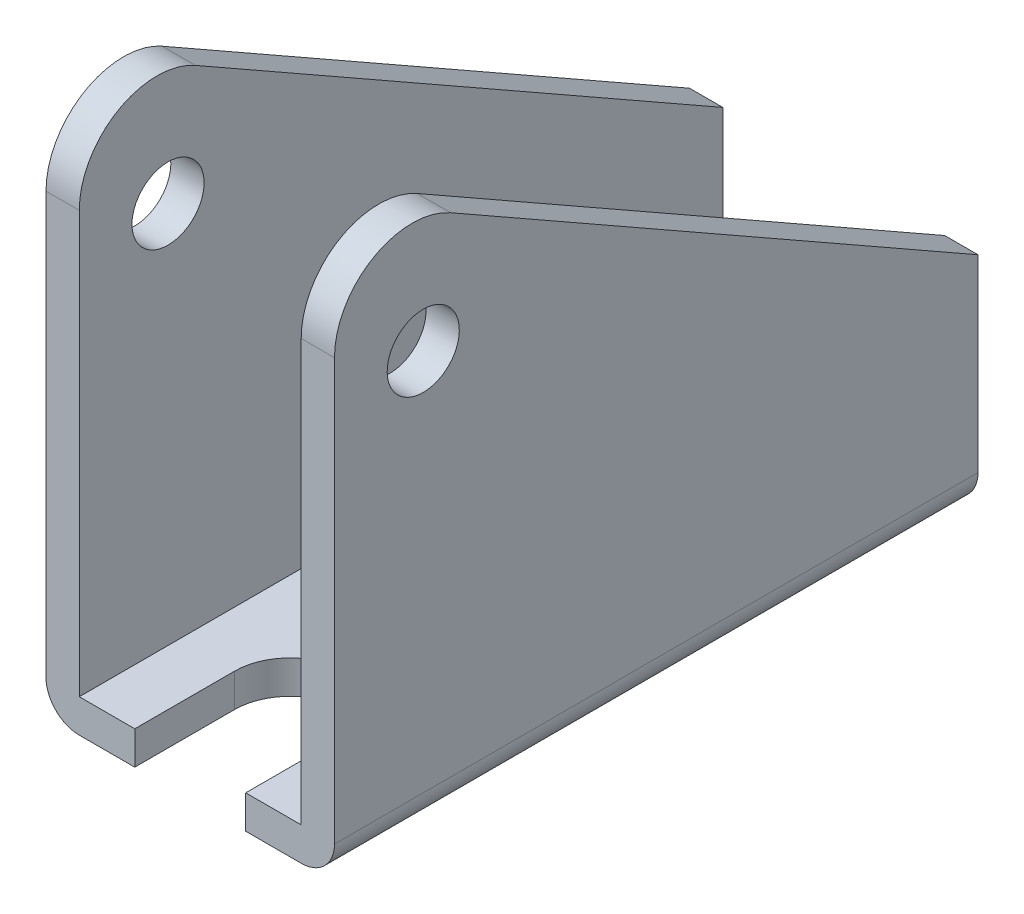
ISO-10303-21;
HEADER;
FILE_DESCRIPTION(('STEP AP214'),'2;1');
FILE_NAME('part.step','',(''),(''),'','','');
FILE_SCHEMA(('AUTOMOTIVE_DESIGN { 1 0 10303 214 1 1 1 1 }'));
ENDSEC;
DATA;
#1=APPLICATION_CONTEXT('core data for automotive mechanical design processes');
#2=APPLICATION_PROTOCOL_DEFINITION('international standard','automotive_design',2000,#1);
#3=PRODUCT_CONTEXT('',#1,'mechanical');
#4=PRODUCT('Part','Part','',(#3));
#5=PRODUCT_RELATED_PRODUCT_CATEGORY('part','',(#4));
#6=PRODUCT_DEFINITION_FORMATION('','',#4);
#7=PRODUCT_DEFINITION_CONTEXT('part definition',#1,'design');
#8=PRODUCT_DEFINITION('design','',#6,#7);
#9=PRODUCT_DEFINITION_SHAPE('','',#8);
#10=(LENGTH_UNIT() NAMED_UNIT(*) SI_UNIT(.MILLI.,.METRE.));
#11=(NAMED_UNIT(*) PLANE_ANGLE_UNIT() SI_UNIT($,.RADIAN.));
#12=(NAMED_UNIT(*) SI_UNIT($,.STERADIAN.) SOLID_ANGLE_UNIT());
#13=UNCERTAINTY_MEASURE_WITH_UNIT(LENGTH_MEASURE(1.E-05),#10,'distance_accuracy_value','');
#14=(GEOMETRIC_REPRESENTATION_CONTEXT(3) GLOBAL_UNCERTAINTY_ASSIGNED_CONTEXT((#13)) GLOBAL_UNIT_ASSIGNED_CONTEXT((#10,
#11,#12)) REPRESENTATION_CONTEXT('',''));
#15=CARTESIAN_POINT('',(0.,0.,0.));
#16=DIRECTION('',(0.,0.,1.));
#17=DIRECTION('',(1.,0.,0.));
#18=AXIS2_PLACEMENT_3D('',#15,#16,#17);
#19=CARTESIAN_POINT('',(0.,0.,58.));
#20=DIRECTION('',(0.,0.,1.));
#21=DIRECTION('',(1.,0.,0.));
#22=AXIS2_PLACEMENT_3D('',#19,#20,#21);
#23=PLANE('',#22);
#24=DIRECTION('',(1.,0.,0.));
#25=VECTOR('',#24,1.);
#26=CARTESIAN_POINT('',(-13.,-75.7978366427297,58.));
#27=LINE('',#26,#25);
#28=CARTESIAN_POINT('',(5.,-75.7978366427297,58.));
#29=VERTEX_POINT('',#28);
#30=CARTESIAN_POINT('',(10.,-75.7978366427297,58.));
#31=VERTEX_POINT('',#30);
#32=EDGE_CURVE('E217',#29,#31,#27,.T.);
#33=ORIENTED_EDGE('',*,*,#32,.T.);
#34=CARTESIAN_POINT('',(10.,-72.7978366427297,58.));
#35=DIRECTION('',(0.,0.,1.));
#36=DIRECTION('',(1.,0.,0.));
#37=AXIS2_PLACEMENT_3D('',#34,#35,#36);
#38=CIRCLE('',#37,3.);
#39=CARTESIAN_POINT('',(13.,-72.7978366427297,58.));
#40=VERTEX_POINT('',#39);
#41=EDGE_CURVE('E11',#31,#40,#38,.T.);
#42=ORIENTED_EDGE('',*,*,#41,.T.);
#43=DIRECTION('',(0.,1.,0.));
#44=VECTOR('',#43,1.);
#45=CARTESIAN_POINT('',(13.,-20.7978366427297,58.));
#46=LINE('',#45,#44);
#47=CARTESIAN_POINT('',(13.,-34.8343128044483,58.));
#48=VERTEX_POINT('',#47);
#49=EDGE_CURVE('E221',#40,#48,#46,.T.);
#50=ORIENTED_EDGE('',*,*,#49,.T.);
#51=DIRECTION('',(1.,0.,0.));
#52=VECTOR('',#51,1.);
#53=CARTESIAN_POINT('',(10.,-34.8343128044483,58.));
#54=LINE('',#53,#52);
#55=CARTESIAN_POINT('',(10.,-34.8343128044483,58.));
#56=VERTEX_POINT('',#55);
#57=EDGE_CURVE('E263',#48,#56,#54,.F.);
#58=ORIENTED_EDGE('',*,*,#57,.T.);
#59=DIRECTION('',(0.,-1.,0.));
#60=VECTOR('',#59,1.);
#61=CARTESIAN_POINT('',(10.,-72.7978366427297,58.));
#62=LINE('',#61,#60);
#63=CARTESIAN_POINT('',(10.,-72.7978366427297,58.));
#64=VERTEX_POINT('',#63);
#65=EDGE_CURVE('E223',#56,#64,#62,.T.);
#66=ORIENTED_EDGE('',*,*,#65,.T.);
#67=DIRECTION('',(-1.,0.,0.));
#68=VECTOR('',#67,1.);
#69=CARTESIAN_POINT('',(-9.99999999999999,-72.7978366427297,58.));
#70=LINE('',#69,#68);
#71=CARTESIAN_POINT('',(5.,-72.7978366427297,58.));
#72=VERTEX_POINT('',#71);
#73=EDGE_CURVE('E226',#64,#72,#70,.T.);
#74=ORIENTED_EDGE('',*,*,#73,.T.);
#75=DIRECTION('',(0.,1.,0.));
#76=VECTOR('',#75,1.);
#77=CARTESIAN_POINT('',(5.,-75.7978366427297,58.));
#78=LINE('',#77,#76);
#79=EDGE_CURVE('E187',#29,#72,#78,.T.);
#80=ORIENTED_EDGE('',*,*,#79,.F.);
#81=EDGE_LOOP('',(#33,#42,#50,#58,#66,#74,#80));
#82=FACE_BOUND('',#81,.T.);
#83=ADVANCED_FACE('F36',(#82),#23,.T.);
#84=CARTESIAN_POINT('',(-13.,-20.7978366427297,58.));
#85=DIRECTION('',(1.,0.,0.));
#86=DIRECTION('',(0.,1.,0.));
#87=AXIS2_PLACEMENT_3D('',#84,#85,#86);
#88=PLANE('',#87);
#89=CARTESIAN_POINT('',(-13.,-38.2978366427297,50.));
#90=DIRECTION('',(1.,0.,0.));
#91=DIRECTION('',(0.,1.,0.));
#92=AXIS2_PLACEMENT_3D('',#89,#90,#91);
#93=CIRCLE('',#92,3.25);
#94=CARTESIAN_POINT('',(-13.,-35.0478366427297,50.));
#95=VERTEX_POINT('',#94);
#96=EDGE_CURVE('E190',#95,#95,#93,.T.);
#97=ORIENTED_EDGE('',*,*,#96,.T.);
#98=EDGE_LOOP('',(#97));
#99=FACE_BOUND('',#98,.T.);
#100=DIRECTION('',(0.,-1.,0.));
#101=VECTOR('',#100,1.);
#102=CARTESIAN_POINT('',(-13.,-20.7978366427297,0.));
#103=LINE('',#102,#101);
#104=CARTESIAN_POINT('',(-13.,-55.7978366427297,0.));
#105=VERTEX_POINT('',#104);
#106=CARTESIAN_POINT('',(-13.,-72.7978366427297,0.));
#107=VERTEX_POINT('',#106);
#108=EDGE_CURVE('E214',#105,#107,#103,.T.);
#109=ORIENTED_EDGE('',*,*,#108,.T.);
#110=DIRECTION('',(0.,0.,-1.));
#111=VECTOR('',#110,1.);
#112=CARTESIAN_POINT('',(-13.,-72.7978366427297,58.));
#113=LINE('',#112,#111);
#114=CARTESIAN_POINT('',(-13.,-72.7978366427297,58.));
#115=VERTEX_POINT('',#114);
#116=EDGE_CURVE('E57',#107,#115,#113,.F.);
#117=ORIENTED_EDGE('',*,*,#116,.T.);
#118=DIRECTION('',(0.,-1.,0.));
#119=VECTOR('',#118,1.);
#120=CARTESIAN_POINT('',(-13.,-20.7978366427297,58.));
#121=LINE('',#120,#119);
#122=CARTESIAN_POINT('',(-13.,-34.8343128044483,58.));
#123=VERTEX_POINT('',#122);
#124=EDGE_CURVE('E215',#123,#115,#121,.T.);
#125=ORIENTED_EDGE('',*,*,#124,.F.);
#126=CARTESIAN_POINT('',(-13.,-34.8343128044483,51.));
#127=DIRECTION('',(1.,0.,0.));
#128=DIRECTION('',(0.,1.,0.));
#129=AXIS2_PLACEMENT_3D('',#126,#127,#128);
#130=CIRCLE('',#129,7.);
#131=CARTESIAN_POINT('',(-13.,-28.75016598028,47.5383302552146));
#132=VERTEX_POINT('',#131);
#133=EDGE_CURVE('E272',#123,#132,#130,.F.);
#134=ORIENTED_EDGE('',*,*,#133,.T.);
#135=DIRECTION('',(0.,-0.494524249255059,-0.869163832024044));
#136=VECTOR('',#135,1.);
#137=CARTESIAN_POINT('',(-13.,-22.7978366427297,58.));
#138=LINE('',#137,#136);
#139=EDGE_CURVE('E198',#132,#105,#138,.T.);
#140=ORIENTED_EDGE('',*,*,#139,.T.);
#141=EDGE_LOOP('',(#109,#117,#125,#134,#140));
#142=FACE_BOUND('',#141,.T.);
#143=ADVANCED_FACE('F325',(#99,#142),#88,.F.);
#144=CARTESIAN_POINT('',(-13.,-75.7978366427297,58.));
#145=DIRECTION('',(0.,1.,0.));
#146=DIRECTION('',(0.,0.,1.));
#147=AXIS2_PLACEMENT_3D('',#144,#145,#146);
#148=PLANE('',#147);
#149=CARTESIAN_POINT('',(0.,-75.7978366427297,12.));
#150=DIRECTION('',(0.,1.,0.));
#151=DIRECTION('',(0.,0.,1.));
#152=AXIS2_PLACEMENT_3D('',#149,#150,#151);
#153=CIRCLE('',#152,4.5);
#154=CARTESIAN_POINT('',(0.,-75.7978366427297,16.5));
#155=VERTEX_POINT('',#154);
#156=EDGE_CURVE('E197',#155,#155,#153,.T.);
#157=ORIENTED_EDGE('',*,*,#156,.T.);
#158=EDGE_LOOP('',(#157));
#159=FACE_BOUND('',#158,.T.);
#160=CARTESIAN_POINT('',(-9.99999999999999,-75.7978366427297,58.));
#161=VERTEX_POINT('',#160);
#162=CARTESIAN_POINT('',(-5.,-75.7978366427297,58.));
#163=VERTEX_POINT('',#162);
#164=EDGE_CURVE('E219',#161,#163,#27,.T.);
#165=ORIENTED_EDGE('',*,*,#164,.F.);
#166=DIRECTION('',(0.,0.,-1.));
#167=VECTOR('',#166,1.);
#168=CARTESIAN_POINT('',(-9.99999999999999,-75.7978366427297,58.));
#169=LINE('',#168,#167);
#170=CARTESIAN_POINT('',(-9.99999999999999,-75.7978366427297,0.));
#171=VERTEX_POINT('',#170);
#172=EDGE_CURVE('E276',#161,#171,#169,.T.);
#173=ORIENTED_EDGE('',*,*,#172,.T.);
#174=DIRECTION('',(1.,0.,0.));
#175=VECTOR('',#174,1.);
#176=CARTESIAN_POINT('',(-13.,-75.7978366427297,0.));
#177=LINE('',#176,#175);
#178=CARTESIAN_POINT('',(10.,-75.7978366427297,0.));
#179=VERTEX_POINT('',#178);
#180=EDGE_CURVE('E234',#171,#179,#177,.T.);
#181=ORIENTED_EDGE('',*,*,#180,.T.);
#182=DIRECTION('',(0.,0.,-1.));
#183=VECTOR('',#182,1.);
#184=CARTESIAN_POINT('',(10.,-75.7978366427297,58.));
#185=LINE('',#184,#183);
#186=EDGE_CURVE('E274',#179,#31,#185,.F.);
#187=ORIENTED_EDGE('',*,*,#186,.T.);
#188=ORIENTED_EDGE('',*,*,#32,.F.);
#189=DIRECTION('',(0.,0.,-1.));
#190=VECTOR('',#189,1.);
#191=CARTESIAN_POINT('',(4.99999999999999,-75.7978366427297,49.));
#192=LINE('',#191,#190);
#193=CARTESIAN_POINT('',(4.99999999999999,-75.7978366427297,49.));
#194=VERTEX_POINT('',#193);
#195=EDGE_CURVE('E161',#29,#194,#192,.T.);
#196=ORIENTED_EDGE('',*,*,#195,.T.);
#197=CARTESIAN_POINT('',(0.,-75.7978366427297,49.));
#198=DIRECTION('',(0.,1.,0.));
#199=DIRECTION('',(0.,0.,1.));
#200=AXIS2_PLACEMENT_3D('',#197,#198,#199);
#201=CIRCLE('',#200,4.99999999999999);
#202=CARTESIAN_POINT('',(-4.99999999999999,-75.7978366427297,49.));
#203=VERTEX_POINT('',#202);
#204=EDGE_CURVE('E154',#194,#203,#201,.T.);
#205=ORIENTED_EDGE('',*,*,#204,.T.);
#206=DIRECTION('',(0.,0.,1.));
#207=VECTOR('',#206,1.);
#208=CARTESIAN_POINT('',(-4.99999999999999,-75.7978366427297,49.));
#209=LINE('',#208,#207);
#210=EDGE_CURVE('E165',#203,#163,#209,.T.);
#211=ORIENTED_EDGE('',*,*,#210,.T.);
#212=EDGE_LOOP('',(#165,#173,#181,#187,#188,#196,#205,#211));
#213=FACE_BOUND('',#212,.T.);
#214=ADVANCED_FACE('F171',(#159,#213),#148,.F.);
#215=CARTESIAN_POINT('',(13.,-20.7978366427297,58.));
#216=DIRECTION('',(-1.,0.,0.));
#217=DIRECTION('',(0.,-1.,0.));
#218=AXIS2_PLACEMENT_3D('',#215,#216,#217);
#219=PLANE('',#218);
#220=CARTESIAN_POINT('',(13.,-38.2978366427297,50.));
#221=DIRECTION('',(1.,0.,0.));
#222=DIRECTION('',(0.,1.,0.));
#223=AXIS2_PLACEMENT_3D('',#220,#221,#222);
#224=CIRCLE('',#223,3.25);
#225=CARTESIAN_POINT('',(13.,-35.0478366427297,50.));
#226=VERTEX_POINT('',#225);
#227=EDGE_CURVE('E194',#226,#226,#224,.T.);
#228=ORIENTED_EDGE('',*,*,#227,.F.);
#229=EDGE_LOOP('',(#228));
#230=FACE_BOUND('',#229,.T.);
#231=ORIENTED_EDGE('',*,*,#49,.F.);
#232=DIRECTION('',(0.,0.,-1.));
#233=VECTOR('',#232,1.);
#234=CARTESIAN_POINT('',(13.,-72.7978366427297,58.));
#235=LINE('',#234,#233);
#236=CARTESIAN_POINT('',(13.,-72.7978366427297,0.));
#237=VERTEX_POINT('',#236);
#238=EDGE_CURVE('E44',#40,#237,#235,.T.);
#239=ORIENTED_EDGE('',*,*,#238,.T.);
#240=DIRECTION('',(0.,1.,0.));
#241=VECTOR('',#240,1.);
#242=CARTESIAN_POINT('',(13.,-20.7978366427297,0.));
#243=LINE('',#242,#241);
#244=CARTESIAN_POINT('',(13.,-55.7978366427297,0.));
#245=VERTEX_POINT('',#244);
#246=EDGE_CURVE('E237',#237,#245,#243,.T.);
#247=ORIENTED_EDGE('',*,*,#246,.T.);
#248=DIRECTION('',(0.,-0.494524249255059,-0.869163832024044));
#249=VECTOR('',#248,1.);
#250=CARTESIAN_POINT('',(13.,-22.7978366427297,58.));
#251=LINE('',#250,#249);
#252=CARTESIAN_POINT('',(13.,-28.75016598028,47.5383302552146));
#253=VERTEX_POINT('',#252);
#254=EDGE_CURVE('E193',#253,#245,#251,.T.);
#255=ORIENTED_EDGE('',*,*,#254,.F.);
#256=CARTESIAN_POINT('',(13.,-34.8343128044483,51.));
#257=DIRECTION('',(-1.,0.,0.));
#258=DIRECTION('',(0.,-1.,0.));
#259=AXIS2_PLACEMENT_3D('',#256,#257,#258);
#260=CIRCLE('',#259,7.);
#261=EDGE_CURVE('E258',#253,#48,#260,.F.);
#262=ORIENTED_EDGE('',*,*,#261,.T.);
#263=EDGE_LOOP('',(#231,#239,#247,#255,#262));
#264=FACE_BOUND('',#263,.T.);
#265=ADVANCED_FACE('F289',(#230,#264),#219,.F.);
#266=CARTESIAN_POINT('',(10.,-72.7978366427297,58.));
#267=DIRECTION('',(1.,0.,0.));
#268=DIRECTION('',(0.,1.,0.));
#269=AXIS2_PLACEMENT_3D('',#266,#267,#268);
#270=PLANE('',#269);
#271=CARTESIAN_POINT('',(10.,-38.2978366427297,50.));
#272=DIRECTION('',(1.,0.,0.));
#273=DIRECTION('',(0.,1.,0.));
#274=AXIS2_PLACEMENT_3D('',#271,#272,#273);
#275=CIRCLE('',#274,3.25);
#276=CARTESIAN_POINT('',(10.,-35.0478366427297,50.));
#277=VERTEX_POINT('',#276);
#278=EDGE_CURVE('E211',#277,#277,#275,.T.);
#279=ORIENTED_EDGE('',*,*,#278,.T.);
#280=EDGE_LOOP('',(#279));
#281=FACE_BOUND('',#280,.T.);
#282=ORIENTED_EDGE('',*,*,#65,.F.);
#283=CARTESIAN_POINT('',(10.,-34.8343128044483,51.));
#284=DIRECTION('',(1.,0.,0.));
#285=DIRECTION('',(0.,1.,0.));
#286=AXIS2_PLACEMENT_3D('',#283,#284,#285);
#287=CIRCLE('',#286,7.);
#288=CARTESIAN_POINT('',(10.,-28.75016598028,47.5383302552146));
#289=VERTEX_POINT('',#288);
#290=EDGE_CURVE('E265',#56,#289,#287,.F.);
#291=ORIENTED_EDGE('',*,*,#290,.T.);
#292=DIRECTION('',(0.,-0.494524249255059,-0.869163832024044));
#293=VECTOR('',#292,1.);
#294=CARTESIAN_POINT('',(10.,-35.0255482977937,36.508870424433));
#295=LINE('',#294,#293);
#296=CARTESIAN_POINT('',(10.,-55.7978366427297,0.));
#297=VERTEX_POINT('',#296);
#298=EDGE_CURVE('E208',#289,#297,#295,.T.);
#299=ORIENTED_EDGE('',*,*,#298,.T.);
#300=DIRECTION('',(0.,-1.,0.));
#301=VECTOR('',#300,1.);
#302=CARTESIAN_POINT('',(10.,-72.7978366427297,0.));
#303=LINE('',#302,#301);
#304=CARTESIAN_POINT('',(10.,-72.7978366427297,0.));
#305=VERTEX_POINT('',#304);
#306=EDGE_CURVE('E239',#297,#305,#303,.T.);
#307=ORIENTED_EDGE('',*,*,#306,.T.);
#308=DIRECTION('',(0.,0.,-1.));
#309=VECTOR('',#308,1.);
#310=CARTESIAN_POINT('',(10.,-72.7978366427297,58.));
#311=LINE('',#310,#309);
#312=EDGE_CURVE('E247',#64,#305,#311,.T.);
#313=ORIENTED_EDGE('',*,*,#312,.F.);
#314=EDGE_LOOP('',(#282,#291,#299,#307,#313));
#315=FACE_BOUND('',#314,.T.);
#316=ADVANCED_FACE('F309',(#281,#315),#270,.F.);
#317=CARTESIAN_POINT('',(-9.99999999999999,-72.7978366427297,58.));
#318=DIRECTION('',(0.,-1.,0.));
#319=DIRECTION('',(0.,0.,-1.));
#320=AXIS2_PLACEMENT_3D('',#317,#318,#319);
#321=PLANE('',#320);
#322=CARTESIAN_POINT('',(0.,-72.7978366427297,12.));
#323=DIRECTION('',(0.,1.,0.));
#324=DIRECTION('',(0.,0.,1.));
#325=AXIS2_PLACEMENT_3D('',#322,#323,#324);
#326=CIRCLE('',#325,4.5);
#327=CARTESIAN_POINT('',(0.,-72.7978366427297,16.5));
#328=VERTEX_POINT('',#327);
#329=EDGE_CURVE('E179',#328,#328,#326,.T.);
#330=ORIENTED_EDGE('',*,*,#329,.F.);
#331=EDGE_LOOP('',(#330));
#332=FACE_BOUND('',#331,.T.);
#333=CARTESIAN_POINT('',(0.,-72.7978366427297,49.));
#334=DIRECTION('',(0.,1.,0.));
#335=DIRECTION('',(0.,0.,1.));
#336=AXIS2_PLACEMENT_3D('',#333,#334,#335);
#337=CIRCLE('',#336,4.99999999999999);
#338=CARTESIAN_POINT('',(4.99999999999999,-72.7978366427297,49.));
#339=VERTEX_POINT('',#338);
#340=CARTESIAN_POINT('',(-4.99999999999999,-72.7978366427297,49.));
#341=VERTEX_POINT('',#340);
#342=EDGE_CURVE('E157',#339,#341,#337,.T.);
#343=ORIENTED_EDGE('',*,*,#342,.F.);
#344=DIRECTION('',(0.,0.,-1.));
#345=VECTOR('',#344,1.);
#346=CARTESIAN_POINT('',(4.99999999999999,-72.7978366427297,49.));
#347=LINE('',#346,#345);
#348=EDGE_CURVE('E173',#72,#339,#347,.T.);
#349=ORIENTED_EDGE('',*,*,#348,.F.);
#350=ORIENTED_EDGE('',*,*,#73,.F.);
#351=ORIENTED_EDGE('',*,*,#312,.T.);
#352=DIRECTION('',(-1.,0.,0.));
#353=VECTOR('',#352,1.);
#354=CARTESIAN_POINT('',(-9.99999999999999,-72.7978366427297,0.));
#355=LINE('',#354,#353);
#356=CARTESIAN_POINT('',(-9.99999999999999,-72.7978366427297,0.));
#357=VERTEX_POINT('',#356);
#358=EDGE_CURVE('E241',#305,#357,#355,.T.);
#359=ORIENTED_EDGE('',*,*,#358,.T.);
#360=DIRECTION('',(0.,0.,-1.));
#361=VECTOR('',#360,1.);
#362=CARTESIAN_POINT('',(-9.99999999999999,-72.7978366427297,58.));
#363=LINE('',#362,#361);
#364=CARTESIAN_POINT('',(-9.99999999999999,-72.7978366427297,58.));
#365=VERTEX_POINT('',#364);
#366=EDGE_CURVE('E232',#365,#357,#363,.T.);
#367=ORIENTED_EDGE('',*,*,#366,.F.);
#368=CARTESIAN_POINT('',(-5.,-72.7978366427297,58.));
#369=VERTEX_POINT('',#368);
#370=EDGE_CURVE('E225',#369,#365,#70,.T.);
#371=ORIENTED_EDGE('',*,*,#370,.F.);
#372=DIRECTION('',(0.,0.,1.));
#373=VECTOR('',#372,1.);
#374=CARTESIAN_POINT('',(-4.99999999999999,-72.7978366427297,49.));
#375=LINE('',#374,#373);
#376=EDGE_CURVE('E176',#341,#369,#375,.T.);
#377=ORIENTED_EDGE('',*,*,#376,.F.);
#378=EDGE_LOOP('',(#343,#349,#350,#351,#359,#367,#371,#377));
#379=FACE_BOUND('',#378,.T.);
#380=ADVANCED_FACE('F313',(#332,#379),#321,.F.);
#381=CARTESIAN_POINT('',(-9.99999999999999,-20.7978366427297,58.));
#382=DIRECTION('',(-1.,0.,0.));
#383=DIRECTION('',(0.,-1.,0.));
#384=AXIS2_PLACEMENT_3D('',#381,#382,#383);
#385=PLANE('',#384);
#386=CARTESIAN_POINT('',(-9.99999999999999,-38.2978366427297,50.));
#387=DIRECTION('',(-1.,0.,0.));
#388=DIRECTION('',(0.,-1.,0.));
#389=AXIS2_PLACEMENT_3D('',#386,#387,#388);
#390=CIRCLE('',#389,3.25);
#391=CARTESIAN_POINT('',(-9.99999999999999,-41.5478366427297,50.));
#392=VERTEX_POINT('',#391);
#393=EDGE_CURVE('E210',#392,#392,#390,.T.);
#394=ORIENTED_EDGE('',*,*,#393,.T.);
#395=EDGE_LOOP('',(#394));
#396=FACE_BOUND('',#395,.T.);
#397=DIRECTION('',(0.,0.494524249255059,0.869163832024044));
#398=VECTOR('',#397,1.);
#399=CARTESIAN_POINT('',(-9.99999999999999,-22.3087281765271,58.8596451830227));
#400=LINE('',#399,#398);
#401=CARTESIAN_POINT('',(-9.99999999999999,-55.7978366427297,0.));
#402=VERTEX_POINT('',#401);
#403=CARTESIAN_POINT('',(-9.99999999999999,-28.75016598028,47.5383302552146));
#404=VERTEX_POINT('',#403);
#405=EDGE_CURVE('E205',#402,#404,#400,.T.);
#406=ORIENTED_EDGE('',*,*,#405,.T.);
#407=CARTESIAN_POINT('',(-9.99999999999999,-34.8343128044483,51.));
#408=DIRECTION('',(-1.,0.,0.));
#409=DIRECTION('',(0.,-1.,0.));
#410=AXIS2_PLACEMENT_3D('',#407,#408,#409);
#411=CIRCLE('',#410,7.);
#412=CARTESIAN_POINT('',(-9.99999999999999,-34.8343128044483,58.));
#413=VERTEX_POINT('',#412);
#414=EDGE_CURVE('E270',#404,#413,#411,.F.);
#415=ORIENTED_EDGE('',*,*,#414,.T.);
#416=DIRECTION('',(0.,1.,0.));
#417=VECTOR('',#416,1.);
#418=CARTESIAN_POINT('',(-9.99999999999999,-20.7978366427297,58.));
#419=LINE('',#418,#417);
#420=EDGE_CURVE('E229',#365,#413,#419,.T.);
#421=ORIENTED_EDGE('',*,*,#420,.F.);
#422=ORIENTED_EDGE('',*,*,#366,.T.);
#423=DIRECTION('',(0.,1.,0.));
#424=VECTOR('',#423,1.);
#425=CARTESIAN_POINT('',(-9.99999999999999,-20.7978366427297,0.));
#426=LINE('',#425,#424);
#427=EDGE_CURVE('E218',#357,#402,#426,.T.);
#428=ORIENTED_EDGE('',*,*,#427,.T.);
#429=EDGE_LOOP('',(#406,#415,#421,#422,#428));
#430=FACE_BOUND('',#429,.T.);
#431=ADVANCED_FACE('F336',(#396,#430),#385,.F.);
#432=ORIENTED_EDGE('',*,*,#124,.T.);
#433=CARTESIAN_POINT('',(-9.99999999999999,-72.7978366427297,58.));
#434=DIRECTION('',(0.,0.,1.));
#435=DIRECTION('',(1.,0.,0.));
#436=AXIS2_PLACEMENT_3D('',#433,#434,#435);
#437=CIRCLE('',#436,3.);
#438=EDGE_CURVE('E284',#115,#161,#437,.T.);
#439=ORIENTED_EDGE('',*,*,#438,.T.);
#440=ORIENTED_EDGE('',*,*,#164,.T.);
#441=DIRECTION('',(0.,1.,0.));
#442=VECTOR('',#441,1.);
#443=CARTESIAN_POINT('',(-5.,-75.7978366427297,58.));
#444=LINE('',#443,#442);
#445=EDGE_CURVE('E160',#163,#369,#444,.T.);
#446=ORIENTED_EDGE('',*,*,#445,.T.);
#447=ORIENTED_EDGE('',*,*,#370,.T.);
#448=ORIENTED_EDGE('',*,*,#420,.T.);
#449=DIRECTION('',(1.,0.,0.));
#450=VECTOR('',#449,1.);
#451=CARTESIAN_POINT('',(-13.,-34.8343128044483,58.));
#452=LINE('',#451,#450);
#453=EDGE_CURVE('E261',#413,#123,#452,.F.);
#454=ORIENTED_EDGE('',*,*,#453,.T.);
#455=EDGE_LOOP('',(#432,#439,#440,#446,#447,#448,#454));
#456=FACE_BOUND('',#455,.T.);
#457=ADVANCED_FACE('F327',(#456),#23,.T.);
#458=CARTESIAN_POINT('',(0.,0.,0.));
#459=DIRECTION('',(0.,0.,1.));
#460=DIRECTION('',(1.,0.,0.));
#461=AXIS2_PLACEMENT_3D('',#458,#459,#460);
#462=PLANE('',#461);
#463=ORIENTED_EDGE('',*,*,#180,.F.);
#464=CARTESIAN_POINT('',(-9.99999999999999,-72.7978366427297,0.));
#465=DIRECTION('',(0.,0.,1.));
#466=DIRECTION('',(1.,0.,0.));
#467=AXIS2_PLACEMENT_3D('',#464,#465,#466);
#468=CIRCLE('',#467,3.);
#469=EDGE_CURVE('E281',#171,#107,#468,.F.);
#470=ORIENTED_EDGE('',*,*,#469,.T.);
#471=ORIENTED_EDGE('',*,*,#108,.F.);
#472=DIRECTION('',(1.,0.,0.));
#473=VECTOR('',#472,1.);
#474=CARTESIAN_POINT('',(-13.,-55.7978366427297,0.));
#475=LINE('',#474,#473);
#476=EDGE_CURVE('E200',#105,#402,#475,.T.);
#477=ORIENTED_EDGE('',*,*,#476,.T.);
#478=ORIENTED_EDGE('',*,*,#427,.F.);
#479=ORIENTED_EDGE('',*,*,#358,.F.);
#480=ORIENTED_EDGE('',*,*,#306,.F.);
#481=DIRECTION('',(1.,0.,0.));
#482=VECTOR('',#481,1.);
#483=CARTESIAN_POINT('',(0.,-55.7978366427297,0.));
#484=LINE('',#483,#482);
#485=EDGE_CURVE('E250',#297,#245,#484,.T.);
#486=ORIENTED_EDGE('',*,*,#485,.T.);
#487=ORIENTED_EDGE('',*,*,#246,.F.);
#488=CARTESIAN_POINT('',(10.,-72.7978366427297,0.));
#489=DIRECTION('',(0.,0.,1.));
#490=DIRECTION('',(1.,0.,0.));
#491=AXIS2_PLACEMENT_3D('',#488,#489,#490);
#492=CIRCLE('',#491,3.);
#493=EDGE_CURVE('E279',#237,#179,#492,.F.);
#494=ORIENTED_EDGE('',*,*,#493,.T.);
#495=EDGE_LOOP('',(#463,#470,#471,#477,#478,#479,#480,#486,#487,#494));
#496=FACE_BOUND('',#495,.T.);
#497=ADVANCED_FACE('F294',(#496),#462,.F.);
#498=CARTESIAN_POINT('',(-13.,-22.7978366427297,58.));
#499=DIRECTION('',(0.,-0.869163832024044,0.494524249255059));
#500=DIRECTION('',(0.,-0.494524249255059,-0.869163832024044));
#501=AXIS2_PLACEMENT_3D('',#498,#499,#500);
#502=PLANE('',#501);
#503=ORIENTED_EDGE('',*,*,#298,.F.);
#504=DIRECTION('',(1.,0.,0.));
#505=VECTOR('',#504,1.);
#506=CARTESIAN_POINT('',(13.,-28.75016598028,47.5383302552146));
#507=LINE('',#506,#505);
#508=EDGE_CURVE('E253',#289,#253,#507,.T.);
#509=ORIENTED_EDGE('',*,*,#508,.T.);
#510=ORIENTED_EDGE('',*,*,#254,.T.);
#511=ORIENTED_EDGE('',*,*,#485,.F.);
#512=EDGE_LOOP('',(#503,#509,#510,#511));
#513=FACE_BOUND('',#512,.T.);
#514=ADVANCED_FACE('F300',(#513),#502,.F.);
#515=ORIENTED_EDGE('',*,*,#139,.F.);
#516=DIRECTION('',(1.,0.,0.));
#517=VECTOR('',#516,1.);
#518=CARTESIAN_POINT('',(-9.99999999999999,-28.75016598028,47.5383302552146));
#519=LINE('',#518,#517);
#520=EDGE_CURVE('E267',#132,#404,#519,.T.);
#521=ORIENTED_EDGE('',*,*,#520,.T.);
#522=ORIENTED_EDGE('',*,*,#405,.F.);
#523=ORIENTED_EDGE('',*,*,#476,.F.);
#524=EDGE_LOOP('',(#515,#521,#522,#523));
#525=FACE_BOUND('',#524,.T.);
#526=ADVANCED_FACE('F353',(#525),#502,.F.);
#527=CARTESIAN_POINT('',(-13.,-38.2978366427297,50.));
#528=DIRECTION('',(1.,0.,0.));
#529=DIRECTION('',(0.,1.,0.));
#530=AXIS2_PLACEMENT_3D('',#527,#528,#529);
#531=CYLINDRICAL_SURFACE('',#530,3.25);
#532=ORIENTED_EDGE('',*,*,#96,.F.);
#533=EDGE_LOOP('',(#532));
#534=FACE_BOUND('',#533,.T.);
#535=ORIENTED_EDGE('',*,*,#393,.F.);
#536=EDGE_LOOP('',(#535));
#537=FACE_BOUND('',#536,.T.);
#538=ADVANCED_FACE('F401',(#534,#537),#531,.F.);
#539=ORIENTED_EDGE('',*,*,#227,.T.);
#540=EDGE_LOOP('',(#539));
#541=FACE_BOUND('',#540,.T.);
#542=ORIENTED_EDGE('',*,*,#278,.F.);
#543=EDGE_LOOP('',(#542));
#544=FACE_BOUND('',#543,.T.);
#545=ADVANCED_FACE('F369',(#541,#544),#531,.F.);
#546=CARTESIAN_POINT('',(-13.,-34.8343128044483,51.));
#547=DIRECTION('',(-1.,0.,0.));
#548=DIRECTION('',(0.,-1.,0.));
#549=AXIS2_PLACEMENT_3D('',#546,#547,#548);
#550=CYLINDRICAL_SURFACE('',#549,7.);
#551=ORIENTED_EDGE('',*,*,#290,.F.);
#552=ORIENTED_EDGE('',*,*,#57,.F.);
#553=ORIENTED_EDGE('',*,*,#261,.F.);
#554=ORIENTED_EDGE('',*,*,#508,.F.);
#555=EDGE_LOOP('',(#551,#552,#553,#554));
#556=FACE_BOUND('',#555,.T.);
#557=ADVANCED_FACE('F305',(#556),#550,.T.);
#558=CARTESIAN_POINT('',(-13.,-34.8343128044483,51.));
#559=DIRECTION('',(-1.,0.,0.));
#560=DIRECTION('',(0.,-1.,0.));
#561=AXIS2_PLACEMENT_3D('',#558,#559,#560);
#562=CYLINDRICAL_SURFACE('',#561,7.);
#563=ORIENTED_EDGE('',*,*,#133,.F.);
#564=ORIENTED_EDGE('',*,*,#453,.F.);
#565=ORIENTED_EDGE('',*,*,#414,.F.);
#566=ORIENTED_EDGE('',*,*,#520,.F.);
#567=EDGE_LOOP('',(#563,#564,#565,#566));
#568=FACE_BOUND('',#567,.T.);
#569=ADVANCED_FACE('F360',(#568),#562,.T.);
#570=CARTESIAN_POINT('',(0.,-75.7978366427297,49.));
#571=DIRECTION('',(0.,1.,0.));
#572=DIRECTION('',(0.,0.,1.));
#573=AXIS2_PLACEMENT_3D('',#570,#571,#572);
#574=CYLINDRICAL_SURFACE('',#573,4.99999999999999);
#575=ORIENTED_EDGE('',*,*,#342,.T.);
#576=DIRECTION('',(0.,1.,0.));
#577=VECTOR('',#576,1.);
#578=CARTESIAN_POINT('',(-4.99999999999999,-75.7978366427297,49.));
#579=LINE('',#578,#577);
#580=EDGE_CURVE('E150',#203,#341,#579,.T.);
#581=ORIENTED_EDGE('',*,*,#580,.F.);
#582=ORIENTED_EDGE('',*,*,#204,.F.);
#583=DIRECTION('',(0.,1.,0.));
#584=VECTOR('',#583,1.);
#585=CARTESIAN_POINT('',(4.99999999999999,-75.7978366427297,49.));
#586=LINE('',#585,#584);
#587=EDGE_CURVE('E185',#194,#339,#586,.T.);
#588=ORIENTED_EDGE('',*,*,#587,.T.);
#589=EDGE_LOOP('',(#575,#581,#582,#588));
#590=FACE_BOUND('',#589,.T.);
#591=ADVANCED_FACE('F152',(#590),#574,.F.);
#592=CARTESIAN_POINT('',(4.99999999999999,-75.7978366427297,49.));
#593=DIRECTION('',(1.,0.,0.));
#594=DIRECTION('',(0.,0.,-1.));
#595=AXIS2_PLACEMENT_3D('',#592,#593,#594);
#596=PLANE('',#595);
#597=ORIENTED_EDGE('',*,*,#348,.T.);
#598=ORIENTED_EDGE('',*,*,#587,.F.);
#599=ORIENTED_EDGE('',*,*,#195,.F.);
#600=ORIENTED_EDGE('',*,*,#79,.T.);
#601=EDGE_LOOP('',(#597,#598,#599,#600));
#602=FACE_BOUND('',#601,.T.);
#603=ADVANCED_FACE('F367',(#602),#596,.F.);
#604=CARTESIAN_POINT('',(-4.99999999999999,-75.7978366427297,49.));
#605=DIRECTION('',(-1.,0.,0.));
#606=DIRECTION('',(0.,0.,1.));
#607=AXIS2_PLACEMENT_3D('',#604,#605,#606);
#608=PLANE('',#607);
#609=ORIENTED_EDGE('',*,*,#376,.T.);
#610=ORIENTED_EDGE('',*,*,#445,.F.);
#611=ORIENTED_EDGE('',*,*,#210,.F.);
#612=ORIENTED_EDGE('',*,*,#580,.T.);
#613=EDGE_LOOP('',(#609,#610,#611,#612));
#614=FACE_BOUND('',#613,.T.);
#615=ADVANCED_FACE('F166',(#614),#608,.F.);
#616=CARTESIAN_POINT('',(0.,-75.7978366427297,12.));
#617=DIRECTION('',(0.,1.,0.));
#618=DIRECTION('',(0.,0.,1.));
#619=AXIS2_PLACEMENT_3D('',#616,#617,#618);
#620=CYLINDRICAL_SURFACE('',#619,4.5);
#621=ORIENTED_EDGE('',*,*,#156,.F.);
#622=EDGE_LOOP('',(#621));
#623=FACE_BOUND('',#622,.T.);
#624=ORIENTED_EDGE('',*,*,#329,.T.);
#625=EDGE_LOOP('',(#624));
#626=FACE_BOUND('',#625,.T.);
#627=ADVANCED_FACE('F322',(#623,#626),#620,.F.);
#628=CARTESIAN_POINT('',(-9.99999999999999,-72.7978366427297,58.));
#629=DIRECTION('',(0.,0.,-1.));
#630=DIRECTION('',(-1.,0.,0.));
#631=AXIS2_PLACEMENT_3D('',#628,#629,#630);
#632=CYLINDRICAL_SURFACE('',#631,3.);
#633=ORIENTED_EDGE('',*,*,#438,.F.);
#634=ORIENTED_EDGE('',*,*,#116,.F.);
#635=ORIENTED_EDGE('',*,*,#469,.F.);
#636=ORIENTED_EDGE('',*,*,#172,.F.);
#637=EDGE_LOOP('',(#633,#634,#635,#636));
#638=FACE_BOUND('',#637,.T.);
#639=ADVANCED_FACE('F318',(#638),#632,.T.);
#640=CARTESIAN_POINT('',(10.,-72.7978366427297,58.));
#641=DIRECTION('',(0.,0.,-1.));
#642=DIRECTION('',(-1.,0.,0.));
#643=AXIS2_PLACEMENT_3D('',#640,#641,#642);
#644=CYLINDRICAL_SURFACE('',#643,3.);
#645=ORIENTED_EDGE('',*,*,#41,.F.);
#646=ORIENTED_EDGE('',*,*,#186,.F.);
#647=ORIENTED_EDGE('',*,*,#493,.F.);
#648=ORIENTED_EDGE('',*,*,#238,.F.);
#649=EDGE_LOOP('',(#645,#646,#647,#648));
#650=FACE_BOUND('',#649,.T.);
#651=ADVANCED_FACE('F38',(#650),#644,.T.);
#652=CLOSED_SHELL('',(#83,#143,#214,#265,#316,#380,#431,#457,#497,#514,#526,#538,#545,#557,#569,
#591,#603,#615,#627,#639,#651));
#653=MANIFOLD_SOLID_BREP('B2',#652);
#654=ADVANCED_BREP_SHAPE_REPRESENTATION('',(#18,#653),#14);
#655=SHAPE_DEFINITION_REPRESENTATION(#9,#654);
ENDSEC;
END-ISO-10303-21;
